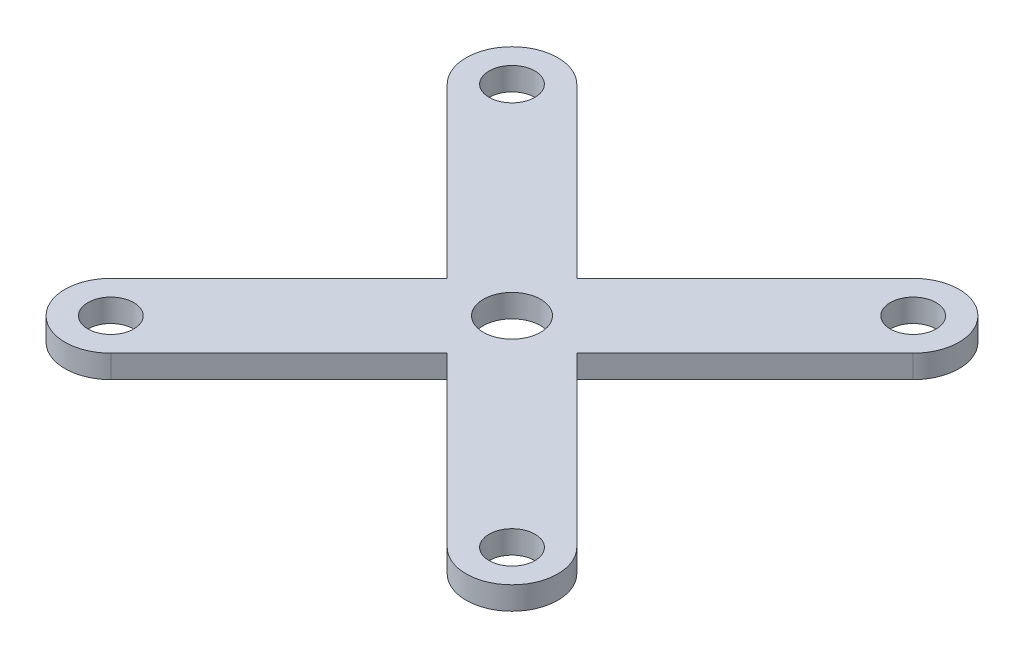
ISO-10303-21;
HEADER;
FILE_DESCRIPTION(('STEP AP214'),'2;1');
FILE_NAME('part.step','',(''),(''),'','','');
FILE_SCHEMA(('AUTOMOTIVE_DESIGN { 1 0 10303 214 1 1 1 1 }'));
ENDSEC;
DATA;
#1=APPLICATION_CONTEXT('core data for automotive mechanical design processes');
#2=APPLICATION_PROTOCOL_DEFINITION('international standard','automotive_design',2000,#1);
#3=PRODUCT_CONTEXT('',#1,'mechanical');
#4=PRODUCT('Part','Part','',(#3));
#5=PRODUCT_RELATED_PRODUCT_CATEGORY('part','',(#4));
#6=PRODUCT_DEFINITION_FORMATION('','',#4);
#7=PRODUCT_DEFINITION_CONTEXT('part definition',#1,'design');
#8=PRODUCT_DEFINITION('design','',#6,#7);
#9=PRODUCT_DEFINITION_SHAPE('','',#8);
#10=(LENGTH_UNIT() NAMED_UNIT(*) SI_UNIT(.MILLI.,.METRE.));
#11=(NAMED_UNIT(*) PLANE_ANGLE_UNIT() SI_UNIT($,.RADIAN.));
#12=(NAMED_UNIT(*) SI_UNIT($,.STERADIAN.) SOLID_ANGLE_UNIT());
#13=UNCERTAINTY_MEASURE_WITH_UNIT(LENGTH_MEASURE(1.E-05),#10,'distance_accuracy_value','');
#14=(GEOMETRIC_REPRESENTATION_CONTEXT(3) GLOBAL_UNCERTAINTY_ASSIGNED_CONTEXT((#13)) GLOBAL_UNIT_ASSIGNED_CONTEXT((#10,
#11,#12)) REPRESENTATION_CONTEXT('',''));
#15=CARTESIAN_POINT('',(0.,0.,0.));
#16=DIRECTION('',(0.,0.,1.));
#17=DIRECTION('',(1.,0.,0.));
#18=AXIS2_PLACEMENT_3D('',#15,#16,#17);
#19=CARTESIAN_POINT('',(-2.82842712474619,2.,-2.82842712474619));
#20=DIRECTION('',(0.707106781186547,0.,0.707106781186547));
#21=DIRECTION('',(0.707106781186548,0.,-0.707106781186548));
#22=AXIS2_PLACEMENT_3D('',#19,#20,#21);
#23=PLANE('',#22);
#24=DIRECTION('',(-0.707106781186548,0.,0.707106781186548));
#25=VECTOR('',#24,1.);
#26=CARTESIAN_POINT('',(-2.82842712474619,0.,-2.82842712474619));
#27=LINE('',#26,#25);
#28=CARTESIAN_POINT('',(-5.65685424949238,0.,0.));
#29=VERTEX_POINT('',#28);
#30=CARTESIAN_POINT('',(-20.3293199591132,0.,14.6724657096209));
#31=VERTEX_POINT('',#30);
#32=EDGE_CURVE('E166',#29,#31,#27,.T.);
#33=ORIENTED_EDGE('',*,*,#32,.T.);
#34=DIRECTION('',(0.,-1.,0.));
#35=VECTOR('',#34,1.);
#36=CARTESIAN_POINT('',(-20.3293199591132,2.,14.6724657096209));
#37=LINE('',#36,#35);
#38=CARTESIAN_POINT('',(-20.3293199591132,2.,14.6724657096209));
#39=VERTEX_POINT('',#38);
#40=EDGE_CURVE('E11',#39,#31,#37,.T.);
#41=ORIENTED_EDGE('',*,*,#40,.F.);
#42=DIRECTION('',(-0.707106781186548,0.,0.707106781186548));
#43=VECTOR('',#42,1.);
#44=CARTESIAN_POINT('',(-2.82842712474619,2.,-2.82842712474619));
#45=LINE('',#44,#43);
#46=CARTESIAN_POINT('',(-5.65685424949238,2.,0.));
#47=VERTEX_POINT('',#46);
#48=EDGE_CURVE('E258',#47,#39,#45,.T.);
#49=ORIENTED_EDGE('',*,*,#48,.F.);
#50=DIRECTION('',(0.,-1.,0.));
#51=VECTOR('',#50,1.);
#52=CARTESIAN_POINT('',(-5.65685424949238,2.,0.));
#53=LINE('',#52,#51);
#54=EDGE_CURVE('E149',#47,#29,#53,.T.);
#55=ORIENTED_EDGE('',*,*,#54,.T.);
#56=EDGE_LOOP('',(#33,#41,#49,#55));
#57=FACE_BOUND('',#56,.T.);
#58=ADVANCED_FACE('F34',(#57),#23,.F.);
#59=CARTESIAN_POINT('',(-17.500892834367,2.,17.500892834367));
#60=DIRECTION('',(0.,-1.,0.));
#61=DIRECTION('',(0.,0.,-1.));
#62=AXIS2_PLACEMENT_3D('',#59,#60,#61);
#63=CYLINDRICAL_SURFACE('',#62,4.);
#64=CARTESIAN_POINT('',(-17.500892834367,0.,17.500892834367));
#65=DIRECTION('',(0.,1.,0.));
#66=DIRECTION('',(0.,0.,1.));
#67=AXIS2_PLACEMENT_3D('',#64,#65,#66);
#68=CIRCLE('',#67,4.);
#69=CARTESIAN_POINT('',(-14.6724657096209,0.,20.3293199591132));
#70=VERTEX_POINT('',#69);
#71=EDGE_CURVE('E169',#31,#70,#68,.T.);
#72=ORIENTED_EDGE('',*,*,#71,.T.);
#73=DIRECTION('',(0.,-1.,0.));
#74=VECTOR('',#73,1.);
#75=CARTESIAN_POINT('',(-14.6724657096209,2.,20.3293199591132));
#76=LINE('',#75,#74);
#77=CARTESIAN_POINT('',(-14.6724657096209,2.,20.3293199591132));
#78=VERTEX_POINT('',#77);
#79=EDGE_CURVE('E43',#78,#70,#76,.T.);
#80=ORIENTED_EDGE('',*,*,#79,.F.);
#81=CARTESIAN_POINT('',(-17.500892834367,2.,17.500892834367));
#82=DIRECTION('',(0.,1.,0.));
#83=DIRECTION('',(0.,0.,1.));
#84=AXIS2_PLACEMENT_3D('',#81,#82,#83);
#85=CIRCLE('',#84,4.);
#86=EDGE_CURVE('E102',#39,#78,#85,.T.);
#87=ORIENTED_EDGE('',*,*,#86,.F.);
#88=ORIENTED_EDGE('',*,*,#40,.T.);
#89=EDGE_LOOP('',(#72,#80,#87,#88));
#90=FACE_BOUND('',#89,.T.);
#91=ADVANCED_FACE('F218',(#90),#63,.T.);
#92=CARTESIAN_POINT('',(2.82842712474619,2.,2.82842712474619));
#93=DIRECTION('',(0.707106781186547,0.,0.707106781186547));
#94=DIRECTION('',(0.707106781186548,0.,-0.707106781186548));
#95=AXIS2_PLACEMENT_3D('',#92,#93,#94);
#96=PLANE('',#95);
#97=DIRECTION('',(-0.707106781186548,0.,0.707106781186548));
#98=VECTOR('',#97,1.);
#99=CARTESIAN_POINT('',(2.82842712474619,0.,2.82842712474619));
#100=LINE('',#99,#98);
#101=CARTESIAN_POINT('',(0.,0.,5.65685424949238));
#102=VERTEX_POINT('',#101);
#103=EDGE_CURVE('E172',#102,#70,#100,.T.);
#104=ORIENTED_EDGE('',*,*,#103,.F.);
#105=DIRECTION('',(0.,-1.,0.));
#106=VECTOR('',#105,1.);
#107=CARTESIAN_POINT('',(0.,2.,5.65685424949238));
#108=LINE('',#107,#106);
#109=CARTESIAN_POINT('',(0.,2.,5.65685424949238));
#110=VERTEX_POINT('',#109);
#111=EDGE_CURVE('E211',#110,#102,#108,.T.);
#112=ORIENTED_EDGE('',*,*,#111,.F.);
#113=DIRECTION('',(-0.707106781186548,0.,0.707106781186548));
#114=VECTOR('',#113,1.);
#115=CARTESIAN_POINT('',(2.82842712474619,2.,2.82842712474619));
#116=LINE('',#115,#114);
#117=EDGE_CURVE('E217',#110,#78,#116,.T.);
#118=ORIENTED_EDGE('',*,*,#117,.T.);
#119=ORIENTED_EDGE('',*,*,#79,.T.);
#120=EDGE_LOOP('',(#104,#112,#118,#119));
#121=FACE_BOUND('',#120,.T.);
#122=ADVANCED_FACE('F215',(#121),#96,.T.);
#123=CARTESIAN_POINT('',(-2.82842712474619,2.,2.82842712474619));
#124=DIRECTION('',(0.707106781186547,0.,-0.707106781186547));
#125=DIRECTION('',(-0.707106781186548,0.,-0.707106781186548));
#126=AXIS2_PLACEMENT_3D('',#123,#124,#125);
#127=PLANE('',#126);
#128=DIRECTION('',(0.707106781186548,0.,0.707106781186548));
#129=VECTOR('',#128,1.);
#130=CARTESIAN_POINT('',(-2.82842712474619,0.,2.82842712474619));
#131=LINE('',#130,#129);
#132=CARTESIAN_POINT('',(14.6724657096208,0.,20.3293199591132));
#133=VERTEX_POINT('',#132);
#134=EDGE_CURVE('E175',#102,#133,#131,.T.);
#135=ORIENTED_EDGE('',*,*,#134,.T.);
#136=DIRECTION('',(0.,-1.,0.));
#137=VECTOR('',#136,1.);
#138=CARTESIAN_POINT('',(14.6724657096208,2.,20.3293199591132));
#139=LINE('',#138,#137);
#140=CARTESIAN_POINT('',(14.6724657096208,2.,20.3293199591132));
#141=VERTEX_POINT('',#140);
#142=EDGE_CURVE('E208',#141,#133,#139,.T.);
#143=ORIENTED_EDGE('',*,*,#142,.F.);
#144=DIRECTION('',(0.707106781186548,0.,0.707106781186548));
#145=VECTOR('',#144,1.);
#146=CARTESIAN_POINT('',(-2.82842712474619,2.,2.82842712474619));
#147=LINE('',#146,#145);
#148=EDGE_CURVE('E237',#110,#141,#147,.T.);
#149=ORIENTED_EDGE('',*,*,#148,.F.);
#150=ORIENTED_EDGE('',*,*,#111,.T.);
#151=EDGE_LOOP('',(#135,#143,#149,#150));
#152=FACE_BOUND('',#151,.T.);
#153=ADVANCED_FACE('F227',(#152),#127,.F.);
#154=CARTESIAN_POINT('',(17.500892834367,2.,17.500892834367));
#155=DIRECTION('',(0.,-1.,0.));
#156=DIRECTION('',(0.,0.,-1.));
#157=AXIS2_PLACEMENT_3D('',#154,#155,#156);
#158=CYLINDRICAL_SURFACE('',#157,4.00000000000001);
#159=CARTESIAN_POINT('',(17.500892834367,0.,17.500892834367));
#160=DIRECTION('',(0.,1.,0.));
#161=DIRECTION('',(0.,0.,1.));
#162=AXIS2_PLACEMENT_3D('',#159,#160,#161);
#163=CIRCLE('',#162,4.00000000000001);
#164=CARTESIAN_POINT('',(20.3293199591132,0.,14.6724657096208));
#165=VERTEX_POINT('',#164);
#166=EDGE_CURVE('E177',#133,#165,#163,.T.);
#167=ORIENTED_EDGE('',*,*,#166,.T.);
#168=DIRECTION('',(0.,-1.,0.));
#169=VECTOR('',#168,1.);
#170=CARTESIAN_POINT('',(20.3293199591132,2.,14.6724657096208));
#171=LINE('',#170,#169);
#172=CARTESIAN_POINT('',(20.3293199591132,2.,14.6724657096208));
#173=VERTEX_POINT('',#172);
#174=EDGE_CURVE('E206',#173,#165,#171,.T.);
#175=ORIENTED_EDGE('',*,*,#174,.F.);
#176=CARTESIAN_POINT('',(17.500892834367,2.,17.500892834367));
#177=DIRECTION('',(0.,1.,0.));
#178=DIRECTION('',(0.,0.,1.));
#179=AXIS2_PLACEMENT_3D('',#176,#177,#178);
#180=CIRCLE('',#179,4.00000000000001);
#181=EDGE_CURVE('E233',#141,#173,#180,.T.);
#182=ORIENTED_EDGE('',*,*,#181,.F.);
#183=ORIENTED_EDGE('',*,*,#142,.T.);
#184=EDGE_LOOP('',(#167,#175,#182,#183));
#185=FACE_BOUND('',#184,.T.);
#186=ADVANCED_FACE('F231',(#185),#158,.T.);
#187=CARTESIAN_POINT('',(2.82842712474619,2.,-2.82842712474619));
#188=DIRECTION('',(0.707106781186547,0.,-0.707106781186547));
#189=DIRECTION('',(-0.707106781186548,0.,-0.707106781186548));
#190=AXIS2_PLACEMENT_3D('',#187,#188,#189);
#191=PLANE('',#190);
#192=DIRECTION('',(0.707106781186548,0.,0.707106781186548));
#193=VECTOR('',#192,1.);
#194=CARTESIAN_POINT('',(2.82842712474619,0.,-2.82842712474619));
#195=LINE('',#194,#193);
#196=CARTESIAN_POINT('',(5.65685424949238,0.,0.));
#197=VERTEX_POINT('',#196);
#198=EDGE_CURVE('E180',#197,#165,#195,.T.);
#199=ORIENTED_EDGE('',*,*,#198,.F.);
#200=DIRECTION('',(0.,-1.,0.));
#201=VECTOR('',#200,1.);
#202=CARTESIAN_POINT('',(5.65685424949238,2.,0.));
#203=LINE('',#202,#201);
#204=CARTESIAN_POINT('',(5.65685424949238,2.,0.));
#205=VERTEX_POINT('',#204);
#206=EDGE_CURVE('E204',#205,#197,#203,.T.);
#207=ORIENTED_EDGE('',*,*,#206,.F.);
#208=DIRECTION('',(0.707106781186548,0.,0.707106781186548));
#209=VECTOR('',#208,1.);
#210=CARTESIAN_POINT('',(2.82842712474619,2.,-2.82842712474619));
#211=LINE('',#210,#209);
#212=EDGE_CURVE('E236',#205,#173,#211,.T.);
#213=ORIENTED_EDGE('',*,*,#212,.T.);
#214=ORIENTED_EDGE('',*,*,#174,.T.);
#215=EDGE_LOOP('',(#199,#207,#213,#214));
#216=FACE_BOUND('',#215,.T.);
#217=ADVANCED_FACE('F419',(#216),#191,.T.);
#218=CARTESIAN_POINT('',(2.82842712474619,2.,2.82842712474619));
#219=DIRECTION('',(0.707106781186547,0.,0.707106781186548));
#220=DIRECTION('',(0.707106781186548,0.,-0.707106781186547));
#221=AXIS2_PLACEMENT_3D('',#218,#219,#220);
#222=PLANE('',#221);
#223=DIRECTION('',(-0.707106781186548,0.,0.707106781186547));
#224=VECTOR('',#223,1.);
#225=CARTESIAN_POINT('',(2.82842712474619,0.,2.82842712474619));
#226=LINE('',#225,#224);
#227=CARTESIAN_POINT('',(20.3293199591132,0.,-14.6724657096208));
#228=VERTEX_POINT('',#227);
#229=EDGE_CURVE('E183',#228,#197,#226,.T.);
#230=ORIENTED_EDGE('',*,*,#229,.F.);
#231=DIRECTION('',(0.,-1.,0.));
#232=VECTOR('',#231,1.);
#233=CARTESIAN_POINT('',(20.3293199591132,2.,-14.6724657096208));
#234=LINE('',#233,#232);
#235=CARTESIAN_POINT('',(20.3293199591132,2.,-14.6724657096208));
#236=VERTEX_POINT('',#235);
#237=EDGE_CURVE('E202',#236,#228,#234,.T.);
#238=ORIENTED_EDGE('',*,*,#237,.F.);
#239=DIRECTION('',(-0.707106781186548,0.,0.707106781186547));
#240=VECTOR('',#239,1.);
#241=CARTESIAN_POINT('',(2.82842712474619,2.,2.82842712474619));
#242=LINE('',#241,#240);
#243=EDGE_CURVE('E239',#236,#205,#242,.T.);
#244=ORIENTED_EDGE('',*,*,#243,.T.);
#245=ORIENTED_EDGE('',*,*,#206,.T.);
#246=EDGE_LOOP('',(#230,#238,#244,#245));
#247=FACE_BOUND('',#246,.T.);
#248=ADVANCED_FACE('F410',(#247),#222,.T.);
#249=CARTESIAN_POINT('',(17.500892834367,2.,-17.500892834367));
#250=DIRECTION('',(0.,-1.,0.));
#251=DIRECTION('',(0.,0.,-1.));
#252=AXIS2_PLACEMENT_3D('',#249,#250,#251);
#253=CYLINDRICAL_SURFACE('',#252,4.);
#254=CARTESIAN_POINT('',(17.500892834367,0.,-17.500892834367));
#255=DIRECTION('',(0.,1.,0.));
#256=DIRECTION('',(0.,0.,1.));
#257=AXIS2_PLACEMENT_3D('',#254,#255,#256);
#258=CIRCLE('',#257,4.);
#259=CARTESIAN_POINT('',(14.6724657096208,0.,-20.3293199591132));
#260=VERTEX_POINT('',#259);
#261=EDGE_CURVE('E186',#228,#260,#258,.T.);
#262=ORIENTED_EDGE('',*,*,#261,.T.);
#263=DIRECTION('',(0.,-1.,0.));
#264=VECTOR('',#263,1.);
#265=CARTESIAN_POINT('',(14.6724657096208,2.,-20.3293199591132));
#266=LINE('',#265,#264);
#267=CARTESIAN_POINT('',(14.6724657096208,2.,-20.3293199591132));
#268=VERTEX_POINT('',#267);
#269=EDGE_CURVE('E199',#268,#260,#266,.T.);
#270=ORIENTED_EDGE('',*,*,#269,.F.);
#271=CARTESIAN_POINT('',(17.500892834367,2.,-17.500892834367));
#272=DIRECTION('',(0.,1.,0.));
#273=DIRECTION('',(0.,0.,1.));
#274=AXIS2_PLACEMENT_3D('',#271,#272,#273);
#275=CIRCLE('',#274,4.);
#276=EDGE_CURVE('E246',#236,#268,#275,.T.);
#277=ORIENTED_EDGE('',*,*,#276,.F.);
#278=ORIENTED_EDGE('',*,*,#237,.T.);
#279=EDGE_LOOP('',(#262,#270,#277,#278));
#280=FACE_BOUND('',#279,.T.);
#281=ADVANCED_FACE('F251',(#280),#253,.T.);
#282=CARTESIAN_POINT('',(-2.82842712474619,2.,-2.82842712474619));
#283=DIRECTION('',(0.707106781186547,0.,0.707106781186547));
#284=DIRECTION('',(0.707106781186548,0.,-0.707106781186548));
#285=AXIS2_PLACEMENT_3D('',#282,#283,#284);
#286=PLANE('',#285);
#287=DIRECTION('',(-0.707106781186548,0.,0.707106781186548));
#288=VECTOR('',#287,1.);
#289=CARTESIAN_POINT('',(-2.82842712474619,0.,-2.82842712474619));
#290=LINE('',#289,#288);
#291=CARTESIAN_POINT('',(0.,0.,-5.65685424949238));
#292=VERTEX_POINT('',#291);
#293=EDGE_CURVE('E188',#260,#292,#290,.T.);
#294=ORIENTED_EDGE('',*,*,#293,.T.);
#295=DIRECTION('',(0.,-1.,0.));
#296=VECTOR('',#295,1.);
#297=CARTESIAN_POINT('',(0.,2.,-5.65685424949238));
#298=LINE('',#297,#296);
#299=CARTESIAN_POINT('',(0.,2.,-5.65685424949238));
#300=VERTEX_POINT('',#299);
#301=EDGE_CURVE('E139',#300,#292,#298,.T.);
#302=ORIENTED_EDGE('',*,*,#301,.F.);
#303=DIRECTION('',(-0.707106781186548,0.,0.707106781186548));
#304=VECTOR('',#303,1.);
#305=CARTESIAN_POINT('',(-2.82842712474619,2.,-2.82842712474619));
#306=LINE('',#305,#304);
#307=EDGE_CURVE('E144',#268,#300,#306,.T.);
#308=ORIENTED_EDGE('',*,*,#307,.F.);
#309=ORIENTED_EDGE('',*,*,#269,.T.);
#310=EDGE_LOOP('',(#294,#302,#308,#309));
#311=FACE_BOUND('',#310,.T.);
#312=ADVANCED_FACE('F255',(#311),#286,.F.);
#313=CARTESIAN_POINT('',(2.82842712474619,2.,-2.82842712474619));
#314=DIRECTION('',(0.707106781186547,0.,-0.707106781186547));
#315=DIRECTION('',(-0.707106781186548,0.,-0.707106781186548));
#316=AXIS2_PLACEMENT_3D('',#313,#314,#315);
#317=PLANE('',#316);
#318=DIRECTION('',(0.707106781186548,0.,0.707106781186548));
#319=VECTOR('',#318,1.);
#320=CARTESIAN_POINT('',(2.82842712474619,0.,-2.82842712474619));
#321=LINE('',#320,#319);
#322=CARTESIAN_POINT('',(-14.6724657096208,0.,-20.3293199591132));
#323=VERTEX_POINT('',#322);
#324=EDGE_CURVE('E134',#323,#292,#321,.T.);
#325=ORIENTED_EDGE('',*,*,#324,.F.);
#326=DIRECTION('',(0.,-1.,0.));
#327=VECTOR('',#326,1.);
#328=CARTESIAN_POINT('',(-14.6724657096208,2.,-20.3293199591132));
#329=LINE('',#328,#327);
#330=CARTESIAN_POINT('',(-14.6724657096208,2.,-20.3293199591132));
#331=VERTEX_POINT('',#330);
#332=EDGE_CURVE('E129',#331,#323,#329,.T.);
#333=ORIENTED_EDGE('',*,*,#332,.F.);
#334=DIRECTION('',(0.707106781186548,0.,0.707106781186548));
#335=VECTOR('',#334,1.);
#336=CARTESIAN_POINT('',(2.82842712474619,2.,-2.82842712474619));
#337=LINE('',#336,#335);
#338=EDGE_CURVE('E132',#331,#300,#337,.T.);
#339=ORIENTED_EDGE('',*,*,#338,.T.);
#340=ORIENTED_EDGE('',*,*,#301,.T.);
#341=EDGE_LOOP('',(#325,#333,#339,#340));
#342=FACE_BOUND('',#341,.T.);
#343=ADVANCED_FACE('F131',(#342),#317,.T.);
#344=CARTESIAN_POINT('',(-17.500892834367,2.,-17.500892834367));
#345=DIRECTION('',(0.,-1.,0.));
#346=DIRECTION('',(0.,0.,-1.));
#347=AXIS2_PLACEMENT_3D('',#344,#345,#346);
#348=CYLINDRICAL_SURFACE('',#347,4.);
#349=CARTESIAN_POINT('',(-17.500892834367,0.,-17.500892834367));
#350=DIRECTION('',(0.,1.,0.));
#351=DIRECTION('',(0.,0.,1.));
#352=AXIS2_PLACEMENT_3D('',#349,#350,#351);
#353=CIRCLE('',#352,4.);
#354=CARTESIAN_POINT('',(-20.3293199591132,0.,-14.6724657096208));
#355=VERTEX_POINT('',#354);
#356=EDGE_CURVE('E192',#355,#323,#353,.F.);
#357=ORIENTED_EDGE('',*,*,#356,.F.);
#358=DIRECTION('',(0.,-1.,0.));
#359=VECTOR('',#358,1.);
#360=CARTESIAN_POINT('',(-20.3293199591132,2.,-14.6724657096208));
#361=LINE('',#360,#359);
#362=CARTESIAN_POINT('',(-20.3293199591132,2.,-14.6724657096208));
#363=VERTEX_POINT('',#362);
#364=EDGE_CURVE('E91',#363,#355,#361,.T.);
#365=ORIENTED_EDGE('',*,*,#364,.F.);
#366=CARTESIAN_POINT('',(-17.500892834367,2.,-17.500892834367));
#367=DIRECTION('',(0.,1.,0.));
#368=DIRECTION('',(0.,0.,1.));
#369=AXIS2_PLACEMENT_3D('',#366,#367,#368);
#370=CIRCLE('',#369,4.);
#371=EDGE_CURVE('E142',#363,#331,#370,.F.);
#372=ORIENTED_EDGE('',*,*,#371,.T.);
#373=ORIENTED_EDGE('',*,*,#332,.T.);
#374=EDGE_LOOP('',(#357,#365,#372,#373));
#375=FACE_BOUND('',#374,.T.);
#376=ADVANCED_FACE('F147',(#375),#348,.T.);
#377=CARTESIAN_POINT('',(-17.500892834367,2.,17.500892834367));
#378=DIRECTION('',(0.,-1.,0.));
#379=DIRECTION('',(0.,0.,-1.));
#380=AXIS2_PLACEMENT_3D('',#377,#378,#379);
#381=CYLINDRICAL_SURFACE('',#380,2.00000000000001);
#382=CARTESIAN_POINT('',(-17.500892834367,2.,17.500892834367));
#383=DIRECTION('',(0.,1.,0.));
#384=DIRECTION('',(0.,0.,1.));
#385=AXIS2_PLACEMENT_3D('',#382,#383,#384);
#386=CIRCLE('',#385,2.00000000000001);
#387=CARTESIAN_POINT('',(-17.500892834367,2.,19.500892834367));
#388=VERTEX_POINT('',#387);
#389=EDGE_CURVE('E327',#388,#388,#386,.T.);
#390=ORIENTED_EDGE('',*,*,#389,.T.);
#391=EDGE_LOOP('',(#390));
#392=FACE_BOUND('',#391,.T.);
#393=CARTESIAN_POINT('',(-17.500892834367,0.,17.500892834367));
#394=DIRECTION('',(0.,1.,0.));
#395=DIRECTION('',(0.,0.,1.));
#396=AXIS2_PLACEMENT_3D('',#393,#394,#395);
#397=CIRCLE('',#396,2.00000000000001);
#398=CARTESIAN_POINT('',(-17.500892834367,0.,19.500892834367));
#399=VERTEX_POINT('',#398);
#400=EDGE_CURVE('E163',#399,#399,#397,.T.);
#401=ORIENTED_EDGE('',*,*,#400,.F.);
#402=EDGE_LOOP('',(#401));
#403=FACE_BOUND('',#402,.T.);
#404=ADVANCED_FACE('F280',(#392,#403),#381,.F.);
#405=CARTESIAN_POINT('',(17.500892834367,2.,17.500892834367));
#406=DIRECTION('',(0.,-1.,0.));
#407=DIRECTION('',(0.,0.,-1.));
#408=AXIS2_PLACEMENT_3D('',#405,#406,#407);
#409=CYLINDRICAL_SURFACE('',#408,2.00000000000001);
#410=CARTESIAN_POINT('',(17.500892834367,2.,17.500892834367));
#411=DIRECTION('',(0.,1.,0.));
#412=DIRECTION('',(0.,0.,1.));
#413=AXIS2_PLACEMENT_3D('',#410,#411,#412);
#414=CIRCLE('',#413,2.00000000000001);
#415=CARTESIAN_POINT('',(17.500892834367,2.,19.500892834367));
#416=VERTEX_POINT('',#415);
#417=EDGE_CURVE('E324',#416,#416,#414,.T.);
#418=ORIENTED_EDGE('',*,*,#417,.T.);
#419=EDGE_LOOP('',(#418));
#420=FACE_BOUND('',#419,.T.);
#421=CARTESIAN_POINT('',(17.500892834367,0.,17.500892834367));
#422=DIRECTION('',(0.,1.,0.));
#423=DIRECTION('',(0.,0.,1.));
#424=AXIS2_PLACEMENT_3D('',#421,#422,#423);
#425=CIRCLE('',#424,2.00000000000001);
#426=CARTESIAN_POINT('',(17.500892834367,0.,19.500892834367));
#427=VERTEX_POINT('',#426);
#428=EDGE_CURVE('E160',#427,#427,#425,.T.);
#429=ORIENTED_EDGE('',*,*,#428,.F.);
#430=EDGE_LOOP('',(#429));
#431=FACE_BOUND('',#430,.T.);
#432=ADVANCED_FACE('F283',(#420,#431),#409,.F.);
#433=CARTESIAN_POINT('',(17.500892834367,2.,-17.500892834367));
#434=DIRECTION('',(0.,-1.,0.));
#435=DIRECTION('',(0.,0.,-1.));
#436=AXIS2_PLACEMENT_3D('',#433,#434,#435);
#437=CYLINDRICAL_SURFACE('',#436,2.00000000000001);
#438=CARTESIAN_POINT('',(17.500892834367,2.,-17.500892834367));
#439=DIRECTION('',(0.,1.,0.));
#440=DIRECTION('',(0.,0.,1.));
#441=AXIS2_PLACEMENT_3D('',#438,#439,#440);
#442=CIRCLE('',#441,2.00000000000001);
#443=CARTESIAN_POINT('',(17.500892834367,2.,-15.500892834367));
#444=VERTEX_POINT('',#443);
#445=EDGE_CURVE('E294',#444,#444,#442,.T.);
#446=ORIENTED_EDGE('',*,*,#445,.T.);
#447=EDGE_LOOP('',(#446));
#448=FACE_BOUND('',#447,.T.);
#449=CARTESIAN_POINT('',(17.500892834367,0.,-17.500892834367));
#450=DIRECTION('',(0.,1.,0.));
#451=DIRECTION('',(0.,0.,1.));
#452=AXIS2_PLACEMENT_3D('',#449,#450,#451);
#453=CIRCLE('',#452,2.00000000000001);
#454=CARTESIAN_POINT('',(17.500892834367,0.,-15.500892834367));
#455=VERTEX_POINT('',#454);
#456=EDGE_CURVE('E156',#455,#455,#453,.T.);
#457=ORIENTED_EDGE('',*,*,#456,.F.);
#458=EDGE_LOOP('',(#457));
#459=FACE_BOUND('',#458,.T.);
#460=ADVANCED_FACE('F268',(#448,#459),#437,.F.);
#461=CARTESIAN_POINT('',(-17.500892834367,2.,-17.500892834367));
#462=DIRECTION('',(0.,-1.,0.));
#463=DIRECTION('',(0.,0.,-1.));
#464=AXIS2_PLACEMENT_3D('',#461,#462,#463);
#465=CYLINDRICAL_SURFACE('',#464,2.00000000000001);
#466=CARTESIAN_POINT('',(-17.500892834367,2.,-17.500892834367));
#467=DIRECTION('',(0.,1.,0.));
#468=DIRECTION('',(0.,0.,1.));
#469=AXIS2_PLACEMENT_3D('',#466,#467,#468);
#470=CIRCLE('',#469,2.00000000000001);
#471=CARTESIAN_POINT('',(-17.500892834367,2.,-15.500892834367));
#472=VERTEX_POINT('',#471);
#473=EDGE_CURVE('E195',#472,#472,#470,.T.);
#474=ORIENTED_EDGE('',*,*,#473,.T.);
#475=EDGE_LOOP('',(#474));
#476=FACE_BOUND('',#475,.T.);
#477=CARTESIAN_POINT('',(-17.500892834367,0.,-17.500892834367));
#478=DIRECTION('',(0.,1.,0.));
#479=DIRECTION('',(0.,0.,1.));
#480=AXIS2_PLACEMENT_3D('',#477,#478,#479);
#481=CIRCLE('',#480,2.00000000000001);
#482=CARTESIAN_POINT('',(-17.500892834367,0.,-15.500892834367));
#483=VERTEX_POINT('',#482);
#484=EDGE_CURVE('E153',#483,#483,#481,.T.);
#485=ORIENTED_EDGE('',*,*,#484,.F.);
#486=EDGE_LOOP('',(#485));
#487=FACE_BOUND('',#486,.T.);
#488=ADVANCED_FACE('F36',(#476,#487),#465,.F.);
#489=CARTESIAN_POINT('',(-2.82842712474619,2.,2.82842712474619));
#490=DIRECTION('',(0.707106781186547,0.,-0.707106781186547));
#491=DIRECTION('',(-0.707106781186548,0.,-0.707106781186548));
#492=AXIS2_PLACEMENT_3D('',#489,#490,#491);
#493=PLANE('',#492);
#494=DIRECTION('',(0.707106781186548,0.,0.707106781186548));
#495=VECTOR('',#494,1.);
#496=CARTESIAN_POINT('',(-2.82842712474619,0.,2.82842712474619));
#497=LINE('',#496,#495);
#498=EDGE_CURVE('E94',#355,#29,#497,.T.);
#499=ORIENTED_EDGE('',*,*,#498,.T.);
#500=ORIENTED_EDGE('',*,*,#54,.F.);
#501=DIRECTION('',(0.707106781186548,0.,0.707106781186548));
#502=VECTOR('',#501,1.);
#503=CARTESIAN_POINT('',(-2.82842712474619,2.,2.82842712474619));
#504=LINE('',#503,#502);
#505=EDGE_CURVE('E51',#363,#47,#504,.T.);
#506=ORIENTED_EDGE('',*,*,#505,.F.);
#507=ORIENTED_EDGE('',*,*,#364,.T.);
#508=EDGE_LOOP('',(#499,#500,#506,#507));
#509=FACE_BOUND('',#508,.T.);
#510=ADVANCED_FACE('F259',(#509),#493,.F.);
#511=CARTESIAN_POINT('',(0.,2.,0.));
#512=DIRECTION('',(0.,1.,0.));
#513=DIRECTION('',(0.,0.,1.));
#514=AXIS2_PLACEMENT_3D('',#511,#512,#513);
#515=PLANE('',#514);
#516=CARTESIAN_POINT('',(0.,2.,0.));
#517=DIRECTION('',(0.,1.,0.));
#518=DIRECTION('',(0.,0.,1.));
#519=AXIS2_PLACEMENT_3D('',#516,#517,#518);
#520=CIRCLE('',#519,2.5);
#521=CARTESIAN_POINT('',(0.,2.,2.5));
#522=VERTEX_POINT('',#521);
#523=EDGE_CURVE('E316',#522,#522,#520,.T.);
#524=ORIENTED_EDGE('',*,*,#523,.F.);
#525=EDGE_LOOP('',(#524));
#526=FACE_BOUND('',#525,.T.);
#527=ORIENTED_EDGE('',*,*,#473,.F.);
#528=EDGE_LOOP('',(#527));
#529=FACE_BOUND('',#528,.T.);
#530=ORIENTED_EDGE('',*,*,#445,.F.);
#531=EDGE_LOOP('',(#530));
#532=FACE_BOUND('',#531,.T.);
#533=ORIENTED_EDGE('',*,*,#417,.F.);
#534=EDGE_LOOP('',(#533));
#535=FACE_BOUND('',#534,.T.);
#536=ORIENTED_EDGE('',*,*,#389,.F.);
#537=EDGE_LOOP('',(#536));
#538=FACE_BOUND('',#537,.T.);
#539=ORIENTED_EDGE('',*,*,#48,.T.);
#540=ORIENTED_EDGE('',*,*,#86,.T.);
#541=ORIENTED_EDGE('',*,*,#117,.F.);
#542=ORIENTED_EDGE('',*,*,#148,.T.);
#543=ORIENTED_EDGE('',*,*,#181,.T.);
#544=ORIENTED_EDGE('',*,*,#212,.F.);
#545=ORIENTED_EDGE('',*,*,#243,.F.);
#546=ORIENTED_EDGE('',*,*,#276,.T.);
#547=ORIENTED_EDGE('',*,*,#307,.T.);
#548=ORIENTED_EDGE('',*,*,#338,.F.);
#549=ORIENTED_EDGE('',*,*,#371,.F.);
#550=ORIENTED_EDGE('',*,*,#505,.T.);
#551=EDGE_LOOP('',(#539,#540,#541,#542,#543,#544,#545,#546,#547,#548,#549,#550));
#552=FACE_BOUND('',#551,.T.);
#553=ADVANCED_FACE('F141',(#526,#529,#532,#535,#538,#552),#515,.T.);
#554=CARTESIAN_POINT('',(0.,0.,0.));
#555=DIRECTION('',(0.,1.,0.));
#556=DIRECTION('',(0.,0.,1.));
#557=AXIS2_PLACEMENT_3D('',#554,#555,#556);
#558=PLANE('',#557);
#559=CARTESIAN_POINT('',(0.,0.,0.));
#560=DIRECTION('',(0.,1.,0.));
#561=DIRECTION('',(0.,0.,1.));
#562=AXIS2_PLACEMENT_3D('',#559,#560,#561);
#563=CIRCLE('',#562,2.5);
#564=CARTESIAN_POINT('',(0.,0.,2.5));
#565=VERTEX_POINT('',#564);
#566=EDGE_CURVE('E157',#565,#565,#563,.T.);
#567=ORIENTED_EDGE('',*,*,#566,.T.);
#568=EDGE_LOOP('',(#567));
#569=FACE_BOUND('',#568,.T.);
#570=ORIENTED_EDGE('',*,*,#484,.T.);
#571=EDGE_LOOP('',(#570));
#572=FACE_BOUND('',#571,.T.);
#573=ORIENTED_EDGE('',*,*,#456,.T.);
#574=EDGE_LOOP('',(#573));
#575=FACE_BOUND('',#574,.T.);
#576=ORIENTED_EDGE('',*,*,#428,.T.);
#577=EDGE_LOOP('',(#576));
#578=FACE_BOUND('',#577,.T.);
#579=ORIENTED_EDGE('',*,*,#400,.T.);
#580=EDGE_LOOP('',(#579));
#581=FACE_BOUND('',#580,.T.);
#582=ORIENTED_EDGE('',*,*,#32,.F.);
#583=ORIENTED_EDGE('',*,*,#498,.F.);
#584=ORIENTED_EDGE('',*,*,#356,.T.);
#585=ORIENTED_EDGE('',*,*,#324,.T.);
#586=ORIENTED_EDGE('',*,*,#293,.F.);
#587=ORIENTED_EDGE('',*,*,#261,.F.);
#588=ORIENTED_EDGE('',*,*,#229,.T.);
#589=ORIENTED_EDGE('',*,*,#198,.T.);
#590=ORIENTED_EDGE('',*,*,#166,.F.);
#591=ORIENTED_EDGE('',*,*,#134,.F.);
#592=ORIENTED_EDGE('',*,*,#103,.T.);
#593=ORIENTED_EDGE('',*,*,#71,.F.);
#594=EDGE_LOOP('',(#582,#583,#584,#585,#586,#587,#588,#589,#590,#591,#592,#593));
#595=FACE_BOUND('',#594,.T.);
#596=ADVANCED_FACE('F223',(#569,#572,#575,#578,#581,#595),#558,.F.);
#597=CARTESIAN_POINT('',(0.,0.,0.));
#598=DIRECTION('',(0.,1.,0.));
#599=DIRECTION('',(0.,0.,1.));
#600=AXIS2_PLACEMENT_3D('',#597,#598,#599);
#601=CYLINDRICAL_SURFACE('',#600,2.5);
#602=ORIENTED_EDGE('',*,*,#566,.F.);
#603=EDGE_LOOP('',(#602));
#604=FACE_BOUND('',#603,.T.);
#605=ORIENTED_EDGE('',*,*,#523,.T.);
#606=EDGE_LOOP('',(#605));
#607=FACE_BOUND('',#606,.T.);
#608=ADVANCED_FACE('F299',(#604,#607),#601,.F.);
#609=CLOSED_SHELL('',(#58,#91,#122,#153,#186,#217,#248,#281,#312,#343,#376,#404,#432,#460,#488,
#510,#553,#596,#608));
#610=MANIFOLD_SOLID_BREP('B2',#609);
#611=ADVANCED_BREP_SHAPE_REPRESENTATION('',(#18,#610),#14);
#612=SHAPE_DEFINITION_REPRESENTATION(#9,#611);
ENDSEC;
END-ISO-10303-21;
